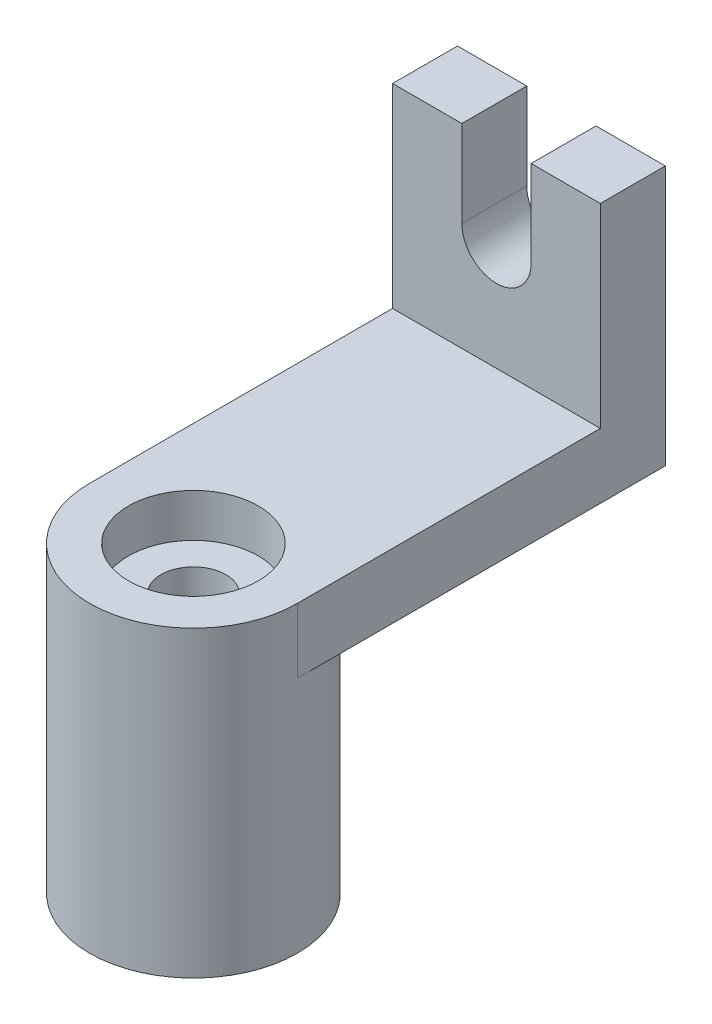
ISO-10303-21;
HEADER;
FILE_DESCRIPTION(('STEP AP214'),'2;1');
FILE_NAME('part.step','',(''),(''),'','','');
FILE_SCHEMA(('AUTOMOTIVE_DESIGN { 1 0 10303 214 1 1 1 1 }'));
ENDSEC;
DATA;
#1=APPLICATION_CONTEXT('core data for automotive mechanical design processes');
#2=APPLICATION_PROTOCOL_DEFINITION('international standard','automotive_design',2000,#1);
#3=PRODUCT_CONTEXT('',#1,'mechanical');
#4=PRODUCT('Part','Part','',(#3));
#5=PRODUCT_RELATED_PRODUCT_CATEGORY('part','',(#4));
#6=PRODUCT_DEFINITION_FORMATION('','',#4);
#7=PRODUCT_DEFINITION_CONTEXT('part definition',#1,'design');
#8=PRODUCT_DEFINITION('design','',#6,#7);
#9=PRODUCT_DEFINITION_SHAPE('','',#8);
#10=(LENGTH_UNIT() NAMED_UNIT(*) SI_UNIT(.MILLI.,.METRE.));
#11=(NAMED_UNIT(*) PLANE_ANGLE_UNIT() SI_UNIT($,.RADIAN.));
#12=(NAMED_UNIT(*) SI_UNIT($,.STERADIAN.) SOLID_ANGLE_UNIT());
#13=UNCERTAINTY_MEASURE_WITH_UNIT(LENGTH_MEASURE(1.E-05),#10,'distance_accuracy_value','');
#14=(GEOMETRIC_REPRESENTATION_CONTEXT(3) GLOBAL_UNCERTAINTY_ASSIGNED_CONTEXT((#13)) GLOBAL_UNIT_ASSIGNED_CONTEXT((#10,
#11,#12)) REPRESENTATION_CONTEXT('',''));
#15=CARTESIAN_POINT('',(0.,0.,0.));
#16=DIRECTION('',(0.,0.,1.));
#17=DIRECTION('',(1.,0.,0.));
#18=AXIS2_PLACEMENT_3D('',#15,#16,#17);
#19=CARTESIAN_POINT('',(24.,115.,-85.));
#20=DIRECTION('',(0.,-1.,0.));
#21=DIRECTION('',(0.,0.,-1.));
#22=AXIS2_PLACEMENT_3D('',#19,#20,#21);
#23=PLANE('',#22);
#24=DIRECTION('',(-1.,0.,0.));
#25=VECTOR('',#24,1.);
#26=CARTESIAN_POINT('',(24.,115.,-85.));
#27=LINE('',#26,#25);
#28=CARTESIAN_POINT('',(24.,115.,-85.));
#29=VERTEX_POINT('',#28);
#30=CARTESIAN_POINT('',(8.,115.,-85.));
#31=VERTEX_POINT('',#30);
#32=EDGE_CURVE('E186',#29,#31,#27,.T.);
#33=ORIENTED_EDGE('',*,*,#32,.T.);
#34=DIRECTION('',(0.,0.,-1.));
#35=VECTOR('',#34,1.);
#36=CARTESIAN_POINT('',(8.,115.,-65.));
#37=LINE('',#36,#35);
#38=CARTESIAN_POINT('',(8.,115.,-70.));
#39=VERTEX_POINT('',#38);
#40=EDGE_CURVE('E137',#39,#31,#37,.T.);
#41=ORIENTED_EDGE('',*,*,#40,.F.);
#42=DIRECTION('',(-1.,0.,0.));
#43=VECTOR('',#42,1.);
#44=CARTESIAN_POINT('',(24.,115.,-70.));
#45=LINE('',#44,#43);
#46=CARTESIAN_POINT('',(24.,115.,-70.));
#47=VERTEX_POINT('',#46);
#48=EDGE_CURVE('E183',#47,#39,#45,.T.);
#49=ORIENTED_EDGE('',*,*,#48,.F.);
#50=DIRECTION('',(0.,0.,1.));
#51=VECTOR('',#50,1.);
#52=CARTESIAN_POINT('',(24.,115.,-85.));
#53=LINE('',#52,#51);
#54=EDGE_CURVE('E161',#29,#47,#53,.T.);
#55=ORIENTED_EDGE('',*,*,#54,.F.);
#56=EDGE_LOOP('',(#33,#41,#49,#55));
#57=FACE_BOUND('',#56,.T.);
#58=ADVANCED_FACE('F33',(#57),#23,.F.);
#59=CARTESIAN_POINT('',(0.,70.,0.));
#60=DIRECTION('',(0.,-1.,0.));
#61=DIRECTION('',(0.,0.,-1.));
#62=AXIS2_PLACEMENT_3D('',#59,#60,#61);
#63=CYLINDRICAL_SURFACE('',#62,7.5);
#64=CARTESIAN_POINT('',(0.,60.,0.));
#65=DIRECTION('',(0.,1.,0.));
#66=DIRECTION('',(0.,0.,1.));
#67=AXIS2_PLACEMENT_3D('',#64,#65,#66);
#68=CIRCLE('',#67,7.5);
#69=CARTESIAN_POINT('',(0.,60.,7.5));
#70=VERTEX_POINT('',#69);
#71=EDGE_CURVE('E149',#70,#70,#68,.T.);
#72=ORIENTED_EDGE('',*,*,#71,.T.);
#73=EDGE_LOOP('',(#72));
#74=FACE_BOUND('',#73,.T.);
#75=CARTESIAN_POINT('',(0.,10.,0.));
#76=DIRECTION('',(0.,-1.,0.));
#77=DIRECTION('',(0.,0.,-1.));
#78=AXIS2_PLACEMENT_3D('',#75,#76,#77);
#79=CIRCLE('',#78,7.5);
#80=CARTESIAN_POINT('',(0.,10.,-7.5));
#81=VERTEX_POINT('',#80);
#82=EDGE_CURVE('E143',#81,#81,#79,.T.);
#83=ORIENTED_EDGE('',*,*,#82,.T.);
#84=EDGE_LOOP('',(#83));
#85=FACE_BOUND('',#84,.T.);
#86=ADVANCED_FACE('F246',(#74,#85),#63,.F.);
#87=CARTESIAN_POINT('',(0.,70.,0.));
#88=DIRECTION('',(0.,-1.,0.));
#89=DIRECTION('',(0.,0.,-1.));
#90=AXIS2_PLACEMENT_3D('',#87,#88,#89);
#91=CYLINDRICAL_SURFACE('',#90,24.);
#92=CARTESIAN_POINT('',(0.,0.,0.));
#93=DIRECTION('',(0.,1.,0.));
#94=DIRECTION('',(0.,0.,1.));
#95=AXIS2_PLACEMENT_3D('',#92,#93,#94);
#96=CIRCLE('',#95,24.);
#97=CARTESIAN_POINT('',(0.,0.,24.));
#98=VERTEX_POINT('',#97);
#99=EDGE_CURVE('E194',#98,#98,#96,.T.);
#100=ORIENTED_EDGE('',*,*,#99,.T.);
#101=EDGE_LOOP('',(#100));
#102=FACE_BOUND('',#101,.T.);
#103=DIRECTION('',(0.,-1.,0.));
#104=VECTOR('',#103,1.);
#105=CARTESIAN_POINT('',(24.,70.,0.));
#106=LINE('',#105,#104);
#107=CARTESIAN_POINT('',(24.,70.,0.));
#108=VERTEX_POINT('',#107);
#109=CARTESIAN_POINT('',(24.,55.,0.));
#110=VERTEX_POINT('',#109);
#111=EDGE_CURVE('E153',#108,#110,#106,.T.);
#112=ORIENTED_EDGE('',*,*,#111,.F.);
#113=CARTESIAN_POINT('',(0.,70.,0.));
#114=DIRECTION('',(0.,1.,0.));
#115=DIRECTION('',(0.,0.,1.));
#116=AXIS2_PLACEMENT_3D('',#113,#114,#115);
#117=CIRCLE('',#116,24.);
#118=CARTESIAN_POINT('',(-24.,70.,0.));
#119=VERTEX_POINT('',#118);
#120=EDGE_CURVE('E195',#119,#108,#117,.T.);
#121=ORIENTED_EDGE('',*,*,#120,.F.);
#122=DIRECTION('',(0.,-1.,0.));
#123=VECTOR('',#122,1.);
#124=CARTESIAN_POINT('',(-24.,70.,0.));
#125=LINE('',#124,#123);
#126=CARTESIAN_POINT('',(-24.,55.,0.));
#127=VERTEX_POINT('',#126);
#128=EDGE_CURVE('E168',#119,#127,#125,.T.);
#129=ORIENTED_EDGE('',*,*,#128,.T.);
#130=CARTESIAN_POINT('',(0.,55.,0.));
#131=DIRECTION('',(0.,1.,0.));
#132=DIRECTION('',(0.,0.,1.));
#133=AXIS2_PLACEMENT_3D('',#130,#131,#132);
#134=CIRCLE('',#133,24.);
#135=EDGE_CURVE('E192',#110,#127,#134,.T.);
#136=ORIENTED_EDGE('',*,*,#135,.F.);
#137=EDGE_LOOP('',(#112,#121,#129,#136));
#138=FACE_BOUND('',#137,.T.);
#139=ADVANCED_FACE('F35',(#102,#138),#91,.T.);
#140=CARTESIAN_POINT('',(0.,70.,0.));
#141=DIRECTION('',(0.,1.,0.));
#142=DIRECTION('',(0.,0.,1.));
#143=AXIS2_PLACEMENT_3D('',#140,#141,#142);
#144=PLANE('',#143);
#145=CARTESIAN_POINT('',(0.,70.,0.));
#146=DIRECTION('',(0.,1.,0.));
#147=DIRECTION('',(0.,0.,1.));
#148=AXIS2_PLACEMENT_3D('',#145,#146,#147);
#149=CIRCLE('',#148,15.);
#150=CARTESIAN_POINT('',(0.,70.,15.));
#151=VERTEX_POINT('',#150);
#152=EDGE_CURVE('E150',#151,#151,#149,.T.);
#153=ORIENTED_EDGE('',*,*,#152,.F.);
#154=EDGE_LOOP('',(#153));
#155=FACE_BOUND('',#154,.T.);
#156=ORIENTED_EDGE('',*,*,#120,.T.);
#157=DIRECTION('',(0.,0.,1.));
#158=VECTOR('',#157,1.);
#159=CARTESIAN_POINT('',(24.,70.,-70.));
#160=LINE('',#159,#158);
#161=CARTESIAN_POINT('',(24.,70.,-70.));
#162=VERTEX_POINT('',#161);
#163=EDGE_CURVE('E165',#162,#108,#160,.T.);
#164=ORIENTED_EDGE('',*,*,#163,.F.);
#165=DIRECTION('',(-1.,0.,0.));
#166=VECTOR('',#165,1.);
#167=CARTESIAN_POINT('',(24.,70.,-70.));
#168=LINE('',#167,#166);
#169=CARTESIAN_POINT('',(-24.,70.,-70.));
#170=VERTEX_POINT('',#169);
#171=EDGE_CURVE('E167',#162,#170,#168,.T.);
#172=ORIENTED_EDGE('',*,*,#171,.T.);
#173=DIRECTION('',(0.,0.,1.));
#174=VECTOR('',#173,1.);
#175=CARTESIAN_POINT('',(-24.,70.,-70.));
#176=LINE('',#175,#174);
#177=EDGE_CURVE('E157',#170,#119,#176,.T.);
#178=ORIENTED_EDGE('',*,*,#177,.T.);
#179=EDGE_LOOP('',(#156,#164,#172,#178));
#180=FACE_BOUND('',#179,.T.);
#181=ADVANCED_FACE('F229',(#155,#180),#144,.T.);
#182=CARTESIAN_POINT('',(0.,0.,0.));
#183=DIRECTION('',(0.,1.,0.));
#184=DIRECTION('',(0.,0.,1.));
#185=AXIS2_PLACEMENT_3D('',#182,#183,#184);
#186=PLANE('',#185);
#187=CARTESIAN_POINT('',(0.,0.,0.));
#188=DIRECTION('',(0.,-1.,0.));
#189=DIRECTION('',(0.,0.,-1.));
#190=AXIS2_PLACEMENT_3D('',#187,#188,#189);
#191=CIRCLE('',#190,15.);
#192=CARTESIAN_POINT('',(0.,0.,-15.));
#193=VERTEX_POINT('',#192);
#194=EDGE_CURVE('E136',#193,#193,#191,.T.);
#195=ORIENTED_EDGE('',*,*,#194,.F.);
#196=EDGE_LOOP('',(#195));
#197=FACE_BOUND('',#196,.T.);
#198=ORIENTED_EDGE('',*,*,#99,.F.);
#199=EDGE_LOOP('',(#198));
#200=FACE_BOUND('',#199,.T.);
#201=ADVANCED_FACE('F236',(#197,#200),#186,.F.);
#202=CARTESIAN_POINT('',(24.,55.,0.));
#203=DIRECTION('',(0.,1.,0.));
#204=DIRECTION('',(0.,0.,1.));
#205=AXIS2_PLACEMENT_3D('',#202,#203,#204);
#206=PLANE('',#205);
#207=DIRECTION('',(0.,0.,-1.));
#208=VECTOR('',#207,1.);
#209=CARTESIAN_POINT('',(24.,55.,0.));
#210=LINE('',#209,#208);
#211=CARTESIAN_POINT('',(24.,55.,-85.));
#212=VERTEX_POINT('',#211);
#213=EDGE_CURVE('E156',#110,#212,#210,.T.);
#214=ORIENTED_EDGE('',*,*,#213,.F.);
#215=ORIENTED_EDGE('',*,*,#135,.T.);
#216=DIRECTION('',(0.,0.,-1.));
#217=VECTOR('',#216,1.);
#218=CARTESIAN_POINT('',(-24.,55.,0.));
#219=LINE('',#218,#217);
#220=CARTESIAN_POINT('',(-24.,55.,-85.));
#221=VERTEX_POINT('',#220);
#222=EDGE_CURVE('E56',#127,#221,#219,.T.);
#223=ORIENTED_EDGE('',*,*,#222,.T.);
#224=DIRECTION('',(-1.,0.,0.));
#225=VECTOR('',#224,1.);
#226=CARTESIAN_POINT('',(24.,55.,-85.));
#227=LINE('',#226,#225);
#228=EDGE_CURVE('E189',#212,#221,#227,.T.);
#229=ORIENTED_EDGE('',*,*,#228,.F.);
#230=EDGE_LOOP('',(#214,#215,#223,#229));
#231=FACE_BOUND('',#230,.T.);
#232=ADVANCED_FACE('F234',(#231),#206,.F.);
#233=CARTESIAN_POINT('',(24.,55.,-85.));
#234=DIRECTION('',(0.,0.,1.));
#235=DIRECTION('',(1.,0.,0.));
#236=AXIS2_PLACEMENT_3D('',#233,#234,#235);
#237=PLANE('',#236);
#238=CARTESIAN_POINT('',(0.,95.,-85.));
#239=DIRECTION('',(0.,0.,-1.));
#240=DIRECTION('',(-1.,0.,0.));
#241=AXIS2_PLACEMENT_3D('',#238,#239,#240);
#242=CIRCLE('',#241,8.);
#243=CARTESIAN_POINT('',(8.,95.,-85.));
#244=VERTEX_POINT('',#243);
#245=CARTESIAN_POINT('',(-8.,95.,-85.));
#246=VERTEX_POINT('',#245);
#247=EDGE_CURVE('E120',#244,#246,#242,.T.);
#248=ORIENTED_EDGE('',*,*,#247,.F.);
#249=DIRECTION('',(0.,-1.,0.));
#250=VECTOR('',#249,1.);
#251=CARTESIAN_POINT('',(8.,95.,-85.));
#252=LINE('',#251,#250);
#253=EDGE_CURVE('E117',#31,#244,#252,.T.);
#254=ORIENTED_EDGE('',*,*,#253,.F.);
#255=ORIENTED_EDGE('',*,*,#32,.F.);
#256=DIRECTION('',(0.,1.,0.));
#257=VECTOR('',#256,1.);
#258=CARTESIAN_POINT('',(24.,55.,-85.));
#259=LINE('',#258,#257);
#260=EDGE_CURVE('E159',#212,#29,#259,.T.);
#261=ORIENTED_EDGE('',*,*,#260,.F.);
#262=ORIENTED_EDGE('',*,*,#228,.T.);
#263=DIRECTION('',(0.,1.,0.));
#264=VECTOR('',#263,1.);
#265=CARTESIAN_POINT('',(-24.,55.,-85.));
#266=LINE('',#265,#264);
#267=CARTESIAN_POINT('',(-24.,115.,-85.));
#268=VERTEX_POINT('',#267);
#269=EDGE_CURVE('E172',#221,#268,#266,.T.);
#270=ORIENTED_EDGE('',*,*,#269,.T.);
#271=CARTESIAN_POINT('',(-8.,115.,-85.));
#272=VERTEX_POINT('',#271);
#273=EDGE_CURVE('E131',#272,#268,#27,.T.);
#274=ORIENTED_EDGE('',*,*,#273,.F.);
#275=DIRECTION('',(0.,1.,0.));
#276=VECTOR('',#275,1.);
#277=CARTESIAN_POINT('',(-8.,95.,-85.));
#278=LINE('',#277,#276);
#279=EDGE_CURVE('E113',#246,#272,#278,.T.);
#280=ORIENTED_EDGE('',*,*,#279,.F.);
#281=EDGE_LOOP('',(#248,#254,#255,#261,#262,#270,#274,#280));
#282=FACE_BOUND('',#281,.T.);
#283=ADVANCED_FACE('F129',(#282),#237,.F.);
#284=CARTESIAN_POINT('',(-8.,115.,-70.));
#285=VERTEX_POINT('',#284);
#286=CARTESIAN_POINT('',(-24.,115.,-70.));
#287=VERTEX_POINT('',#286);
#288=EDGE_CURVE('E182',#285,#287,#45,.T.);
#289=ORIENTED_EDGE('',*,*,#288,.F.);
#290=DIRECTION('',(0.,0.,-1.));
#291=VECTOR('',#290,1.);
#292=CARTESIAN_POINT('',(-8.,115.,-65.));
#293=LINE('',#292,#291);
#294=EDGE_CURVE('E48',#285,#272,#293,.T.);
#295=ORIENTED_EDGE('',*,*,#294,.T.);
#296=ORIENTED_EDGE('',*,*,#273,.T.);
#297=DIRECTION('',(0.,0.,1.));
#298=VECTOR('',#297,1.);
#299=CARTESIAN_POINT('',(-24.,115.,-85.));
#300=LINE('',#299,#298);
#301=EDGE_CURVE('E174',#268,#287,#300,.T.);
#302=ORIENTED_EDGE('',*,*,#301,.T.);
#303=EDGE_LOOP('',(#289,#295,#296,#302));
#304=FACE_BOUND('',#303,.T.);
#305=ADVANCED_FACE('F226',(#304),#23,.F.);
#306=CARTESIAN_POINT('',(24.,115.,-70.));
#307=DIRECTION('',(0.,0.,-1.));
#308=DIRECTION('',(-1.,0.,0.));
#309=AXIS2_PLACEMENT_3D('',#306,#307,#308);
#310=PLANE('',#309);
#311=ORIENTED_EDGE('',*,*,#48,.T.);
#312=DIRECTION('',(0.,-1.,0.));
#313=VECTOR('',#312,1.);
#314=CARTESIAN_POINT('',(8.,115.,-70.));
#315=LINE('',#314,#313);
#316=CARTESIAN_POINT('',(8.,95.,-70.));
#317=VERTEX_POINT('',#316);
#318=EDGE_CURVE('E11',#39,#317,#315,.T.);
#319=ORIENTED_EDGE('',*,*,#318,.T.);
#320=CARTESIAN_POINT('',(0.,95.,-70.));
#321=DIRECTION('',(0.,0.,-1.));
#322=DIRECTION('',(-1.,0.,0.));
#323=AXIS2_PLACEMENT_3D('',#320,#321,#322);
#324=CIRCLE('',#323,8.);
#325=CARTESIAN_POINT('',(-8.,95.,-70.));
#326=VERTEX_POINT('',#325);
#327=EDGE_CURVE('E41',#317,#326,#324,.T.);
#328=ORIENTED_EDGE('',*,*,#327,.T.);
#329=DIRECTION('',(0.,1.,0.));
#330=VECTOR('',#329,1.);
#331=CARTESIAN_POINT('',(-8.,115.,-70.));
#332=LINE('',#331,#330);
#333=EDGE_CURVE('E114',#326,#285,#332,.T.);
#334=ORIENTED_EDGE('',*,*,#333,.T.);
#335=ORIENTED_EDGE('',*,*,#288,.T.);
#336=DIRECTION('',(0.,-1.,0.));
#337=VECTOR('',#336,1.);
#338=CARTESIAN_POINT('',(-24.,115.,-70.));
#339=LINE('',#338,#337);
#340=EDGE_CURVE('E177',#287,#170,#339,.T.);
#341=ORIENTED_EDGE('',*,*,#340,.T.);
#342=ORIENTED_EDGE('',*,*,#171,.F.);
#343=DIRECTION('',(0.,-1.,0.));
#344=VECTOR('',#343,1.);
#345=CARTESIAN_POINT('',(24.,115.,-70.));
#346=LINE('',#345,#344);
#347=EDGE_CURVE('E163',#47,#162,#346,.T.);
#348=ORIENTED_EDGE('',*,*,#347,.F.);
#349=EDGE_LOOP('',(#311,#319,#328,#334,#335,#341,#342,#348));
#350=FACE_BOUND('',#349,.T.);
#351=ADVANCED_FACE('F205',(#350),#310,.F.);
#352=CARTESIAN_POINT('',(24.,0.,0.));
#353=DIRECTION('',(1.,0.,0.));
#354=DIRECTION('',(0.,0.,-1.));
#355=AXIS2_PLACEMENT_3D('',#352,#353,#354);
#356=PLANE('',#355);
#357=ORIENTED_EDGE('',*,*,#111,.T.);
#358=ORIENTED_EDGE('',*,*,#213,.T.);
#359=ORIENTED_EDGE('',*,*,#260,.T.);
#360=ORIENTED_EDGE('',*,*,#54,.T.);
#361=ORIENTED_EDGE('',*,*,#347,.T.);
#362=ORIENTED_EDGE('',*,*,#163,.T.);
#363=EDGE_LOOP('',(#357,#358,#359,#360,#361,#362));
#364=FACE_BOUND('',#363,.T.);
#365=ADVANCED_FACE('F217',(#364),#356,.T.);
#366=CARTESIAN_POINT('',(-24.,0.,0.));
#367=DIRECTION('',(1.,0.,0.));
#368=DIRECTION('',(0.,0.,-1.));
#369=AXIS2_PLACEMENT_3D('',#366,#367,#368);
#370=PLANE('',#369);
#371=ORIENTED_EDGE('',*,*,#128,.F.);
#372=ORIENTED_EDGE('',*,*,#177,.F.);
#373=ORIENTED_EDGE('',*,*,#340,.F.);
#374=ORIENTED_EDGE('',*,*,#301,.F.);
#375=ORIENTED_EDGE('',*,*,#269,.F.);
#376=ORIENTED_EDGE('',*,*,#222,.F.);
#377=EDGE_LOOP('',(#371,#372,#373,#374,#375,#376));
#378=FACE_BOUND('',#377,.T.);
#379=ADVANCED_FACE('F222',(#378),#370,.F.);
#380=CARTESIAN_POINT('',(0.,60.,0.));
#381=DIRECTION('',(0.,1.,0.));
#382=DIRECTION('',(0.,0.,1.));
#383=AXIS2_PLACEMENT_3D('',#380,#381,#382);
#384=CYLINDRICAL_SURFACE('',#383,15.);
#385=CARTESIAN_POINT('',(0.,60.,0.));
#386=DIRECTION('',(0.,1.,0.));
#387=DIRECTION('',(0.,0.,1.));
#388=AXIS2_PLACEMENT_3D('',#385,#386,#387);
#389=CIRCLE('',#388,15.);
#390=CARTESIAN_POINT('',(0.,60.,15.));
#391=VERTEX_POINT('',#390);
#392=EDGE_CURVE('E146',#391,#391,#389,.T.);
#393=ORIENTED_EDGE('',*,*,#392,.F.);
#394=EDGE_LOOP('',(#393));
#395=FACE_BOUND('',#394,.T.);
#396=ORIENTED_EDGE('',*,*,#152,.T.);
#397=EDGE_LOOP('',(#396));
#398=FACE_BOUND('',#397,.T.);
#399=ADVANCED_FACE('F263',(#395,#398),#384,.F.);
#400=CARTESIAN_POINT('',(0.,60.,0.));
#401=DIRECTION('',(0.,1.,0.));
#402=DIRECTION('',(0.,0.,1.));
#403=AXIS2_PLACEMENT_3D('',#400,#401,#402);
#404=PLANE('',#403);
#405=ORIENTED_EDGE('',*,*,#71,.F.);
#406=EDGE_LOOP('',(#405));
#407=FACE_BOUND('',#406,.T.);
#408=ORIENTED_EDGE('',*,*,#392,.T.);
#409=EDGE_LOOP('',(#408));
#410=FACE_BOUND('',#409,.T.);
#411=ADVANCED_FACE('F267',(#407,#410),#404,.T.);
#412=CARTESIAN_POINT('',(0.,10.,0.));
#413=DIRECTION('',(0.,-1.,0.));
#414=DIRECTION('',(0.,0.,-1.));
#415=AXIS2_PLACEMENT_3D('',#412,#413,#414);
#416=CYLINDRICAL_SURFACE('',#415,15.);
#417=CARTESIAN_POINT('',(0.,10.,0.));
#418=DIRECTION('',(0.,-1.,0.));
#419=DIRECTION('',(0.,0.,-1.));
#420=AXIS2_PLACEMENT_3D('',#417,#418,#419);
#421=CIRCLE('',#420,15.);
#422=CARTESIAN_POINT('',(0.,10.,-15.));
#423=VERTEX_POINT('',#422);
#424=EDGE_CURVE('E140',#423,#423,#421,.T.);
#425=ORIENTED_EDGE('',*,*,#424,.F.);
#426=EDGE_LOOP('',(#425));
#427=FACE_BOUND('',#426,.T.);
#428=ORIENTED_EDGE('',*,*,#194,.T.);
#429=EDGE_LOOP('',(#428));
#430=FACE_BOUND('',#429,.T.);
#431=ADVANCED_FACE('F271',(#427,#430),#416,.F.);
#432=CARTESIAN_POINT('',(0.,10.,0.));
#433=DIRECTION('',(0.,-1.,0.));
#434=DIRECTION('',(0.,0.,-1.));
#435=AXIS2_PLACEMENT_3D('',#432,#433,#434);
#436=PLANE('',#435);
#437=ORIENTED_EDGE('',*,*,#82,.F.);
#438=EDGE_LOOP('',(#437));
#439=FACE_BOUND('',#438,.T.);
#440=ORIENTED_EDGE('',*,*,#424,.T.);
#441=EDGE_LOOP('',(#440));
#442=FACE_BOUND('',#441,.T.);
#443=ADVANCED_FACE('F275',(#439,#442),#436,.T.);
#444=CARTESIAN_POINT('',(0.,95.,-65.));
#445=DIRECTION('',(0.,0.,-1.));
#446=DIRECTION('',(-1.,0.,0.));
#447=AXIS2_PLACEMENT_3D('',#444,#445,#446);
#448=CYLINDRICAL_SURFACE('',#447,8.);
#449=DIRECTION('',(0.,0.,-1.));
#450=VECTOR('',#449,1.);
#451=CARTESIAN_POINT('',(8.,95.,-65.));
#452=LINE('',#451,#450);
#453=EDGE_CURVE('E123',#317,#244,#452,.T.);
#454=ORIENTED_EDGE('',*,*,#453,.T.);
#455=ORIENTED_EDGE('',*,*,#247,.T.);
#456=DIRECTION('',(0.,0.,-1.));
#457=VECTOR('',#456,1.);
#458=CARTESIAN_POINT('',(-8.,95.,-65.));
#459=LINE('',#458,#457);
#460=EDGE_CURVE('E109',#326,#246,#459,.T.);
#461=ORIENTED_EDGE('',*,*,#460,.F.);
#462=ORIENTED_EDGE('',*,*,#327,.F.);
#463=EDGE_LOOP('',(#454,#455,#461,#462));
#464=FACE_BOUND('',#463,.T.);
#465=ADVANCED_FACE('F121',(#464),#448,.F.);
#466=CARTESIAN_POINT('',(8.,95.,-65.));
#467=DIRECTION('',(1.,0.,0.));
#468=DIRECTION('',(0.,0.,-1.));
#469=AXIS2_PLACEMENT_3D('',#466,#467,#468);
#470=PLANE('',#469);
#471=ORIENTED_EDGE('',*,*,#40,.T.);
#472=ORIENTED_EDGE('',*,*,#253,.T.);
#473=ORIENTED_EDGE('',*,*,#453,.F.);
#474=ORIENTED_EDGE('',*,*,#318,.F.);
#475=EDGE_LOOP('',(#471,#472,#473,#474));
#476=FACE_BOUND('',#475,.T.);
#477=ADVANCED_FACE('F208',(#476),#470,.F.);
#478=CARTESIAN_POINT('',(-8.,95.,-65.));
#479=DIRECTION('',(-1.,0.,0.));
#480=DIRECTION('',(0.,-1.,0.));
#481=AXIS2_PLACEMENT_3D('',#478,#479,#480);
#482=PLANE('',#481);
#483=ORIENTED_EDGE('',*,*,#460,.T.);
#484=ORIENTED_EDGE('',*,*,#279,.T.);
#485=ORIENTED_EDGE('',*,*,#294,.F.);
#486=ORIENTED_EDGE('',*,*,#333,.F.);
#487=EDGE_LOOP('',(#483,#484,#485,#486));
#488=FACE_BOUND('',#487,.T.);
#489=ADVANCED_FACE('F111',(#488),#482,.F.);
#490=CLOSED_SHELL('',(#58,#86,#139,#181,#201,#232,#283,#305,#351,#365,#379,#399,#411,#431,#443,
#465,#477,#489));
#491=MANIFOLD_SOLID_BREP('B2',#490);
#492=ADVANCED_BREP_SHAPE_REPRESENTATION('',(#18,#491),#14);
#493=SHAPE_DEFINITION_REPRESENTATION(#9,#492);
ENDSEC;
END-ISO-10303-21;
